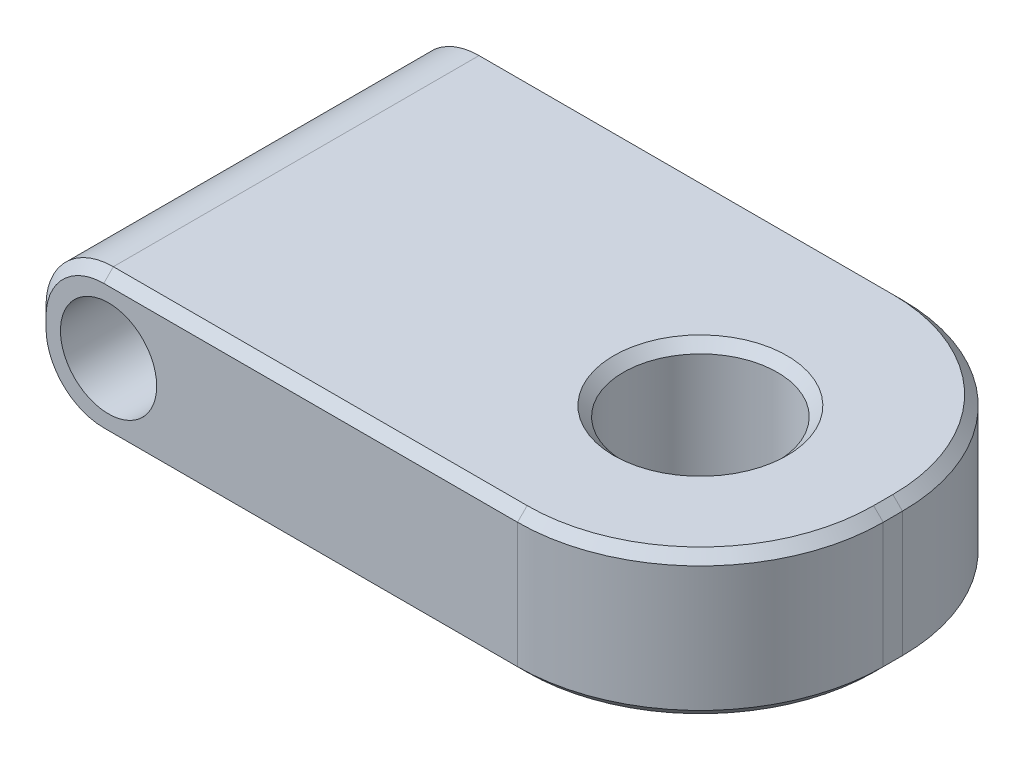
ISO-10303-21;
HEADER;
FILE_DESCRIPTION(('STEP AP214'),'2;1');
FILE_NAME('part.step','',(''),(''),'','','');
FILE_SCHEMA(('AUTOMOTIVE_DESIGN { 1 0 10303 214 1 1 1 1 }'));
ENDSEC;
DATA;
#1=APPLICATION_CONTEXT('core data for automotive mechanical design processes');
#2=APPLICATION_PROTOCOL_DEFINITION('international standard','automotive_design',2000,#1);
#3=PRODUCT_CONTEXT('',#1,'mechanical');
#4=PRODUCT('Part','Part','',(#3));
#5=PRODUCT_RELATED_PRODUCT_CATEGORY('part','',(#4));
#6=PRODUCT_DEFINITION_FORMATION('','',#4);
#7=PRODUCT_DEFINITION_CONTEXT('part definition',#1,'design');
#8=PRODUCT_DEFINITION('design','',#6,#7);
#9=PRODUCT_DEFINITION_SHAPE('','',#8);
#10=(LENGTH_UNIT() NAMED_UNIT(*) SI_UNIT(.MILLI.,.METRE.));
#11=(NAMED_UNIT(*) PLANE_ANGLE_UNIT() SI_UNIT($,.RADIAN.));
#12=(NAMED_UNIT(*) SI_UNIT($,.STERADIAN.) SOLID_ANGLE_UNIT());
#13=UNCERTAINTY_MEASURE_WITH_UNIT(LENGTH_MEASURE(1.E-05),#10,'distance_accuracy_value','');
#14=(GEOMETRIC_REPRESENTATION_CONTEXT(3) GLOBAL_UNCERTAINTY_ASSIGNED_CONTEXT((#13)) GLOBAL_UNIT_ASSIGNED_CONTEXT((#10,
#11,#12)) REPRESENTATION_CONTEXT('',''));
#15=CARTESIAN_POINT('',(0.,0.,0.));
#16=DIRECTION('',(0.,0.,1.));
#17=DIRECTION('',(1.,0.,0.));
#18=AXIS2_PLACEMENT_3D('',#15,#16,#17);
#19=CARTESIAN_POINT('',(-34.5,15.,20.));
#20=DIRECTION('',(1.,0.,0.));
#21=DIRECTION('',(0.,0.,-1.));
#22=AXIS2_PLACEMENT_3D('',#19,#20,#21);
#23=PLANE('',#22);
#24=DIRECTION('',(0.,0.,1.));
#25=VECTOR('',#24,1.);
#26=CARTESIAN_POINT('',(-34.5,8.,-20.));
#27=LINE('',#26,#25);
#28=CARTESIAN_POINT('',(-34.5,8.,19.));
#29=VERTEX_POINT('',#28);
#30=CARTESIAN_POINT('',(-34.5,8.,-19.));
#31=VERTEX_POINT('',#30);
#32=EDGE_CURVE('E248',#29,#31,#27,.F.);
#33=ORIENTED_EDGE('',*,*,#32,.T.);
#34=DIRECTION('',(0.,-1.,0.));
#35=VECTOR('',#34,1.);
#36=CARTESIAN_POINT('',(-34.5,15.,-19.));
#37=LINE('',#36,#35);
#38=CARTESIAN_POINT('',(-34.5,7.,-19.));
#39=VERTEX_POINT('',#38);
#40=EDGE_CURVE('E315',#31,#39,#37,.T.);
#41=ORIENTED_EDGE('',*,*,#40,.T.);
#42=DIRECTION('',(0.,0.,1.));
#43=VECTOR('',#42,1.);
#44=CARTESIAN_POINT('',(-34.5,7.,20.));
#45=LINE('',#44,#43);
#46=CARTESIAN_POINT('',(-34.5,7.,19.));
#47=VERTEX_POINT('',#46);
#48=EDGE_CURVE('E167',#39,#47,#45,.T.);
#49=ORIENTED_EDGE('',*,*,#48,.T.);
#50=DIRECTION('',(0.,1.,0.));
#51=VECTOR('',#50,1.);
#52=CARTESIAN_POINT('',(-34.5,15.,19.));
#53=LINE('',#52,#51);
#54=EDGE_CURVE('E54',#47,#29,#53,.T.);
#55=ORIENTED_EDGE('',*,*,#54,.T.);
#56=EDGE_LOOP('',(#33,#41,#49,#55));
#57=FACE_BOUND('',#56,.T.);
#58=ADVANCED_FACE('F32',(#57),#23,.F.);
#59=CARTESIAN_POINT('',(15.5,15.,20.));
#60=DIRECTION('',(0.,0.,-1.));
#61=DIRECTION('',(-1.,0.,0.));
#62=AXIS2_PLACEMENT_3D('',#59,#60,#61);
#63=PLANE('',#62);
#64=CARTESIAN_POINT('',(-27.,7.5,20.));
#65=DIRECTION('',(0.,0.,1.));
#66=DIRECTION('',(1.,0.,0.));
#67=AXIS2_PLACEMENT_3D('',#64,#65,#66);
#68=CIRCLE('',#67,5.);
#69=CARTESIAN_POINT('',(-22.,7.5,20.));
#70=VERTEX_POINT('',#69);
#71=EDGE_CURVE('E223',#70,#70,#68,.T.);
#72=ORIENTED_EDGE('',*,*,#71,.F.);
#73=EDGE_LOOP('',(#72));
#74=FACE_BOUND('',#73,.T.);
#75=CARTESIAN_POINT('',(-27.5,7.,20.));
#76=DIRECTION('',(0.,0.,-1.));
#77=DIRECTION('',(-1.,0.,0.));
#78=AXIS2_PLACEMENT_3D('',#75,#76,#77);
#79=CIRCLE('',#78,6.00000000000001);
#80=CARTESIAN_POINT('',(-33.5,7.,20.));
#81=VERTEX_POINT('',#80);
#82=CARTESIAN_POINT('',(-27.5,0.999999999999989,20.));
#83=VERTEX_POINT('',#82);
#84=EDGE_CURVE('E311',#81,#83,#79,.F.);
#85=ORIENTED_EDGE('',*,*,#84,.T.);
#86=DIRECTION('',(1.,0.,0.));
#87=VECTOR('',#86,1.);
#88=CARTESIAN_POINT('',(15.5,0.99999999999999,20.));
#89=LINE('',#88,#87);
#90=CARTESIAN_POINT('',(15.5,0.99999999999999,20.));
#91=VERTEX_POINT('',#90);
#92=EDGE_CURVE('E181',#83,#91,#89,.T.);
#93=ORIENTED_EDGE('',*,*,#92,.T.);
#94=DIRECTION('',(0.,-1.,0.));
#95=VECTOR('',#94,1.);
#96=CARTESIAN_POINT('',(15.5,15.,20.));
#97=LINE('',#96,#95);
#98=CARTESIAN_POINT('',(15.5,14.,20.));
#99=VERTEX_POINT('',#98);
#100=EDGE_CURVE('E245',#99,#91,#97,.T.);
#101=ORIENTED_EDGE('',*,*,#100,.F.);
#102=DIRECTION('',(-1.,0.,0.));
#103=VECTOR('',#102,1.);
#104=CARTESIAN_POINT('',(-27.5,14.,20.));
#105=LINE('',#104,#103);
#106=CARTESIAN_POINT('',(-27.5,14.,20.));
#107=VERTEX_POINT('',#106);
#108=EDGE_CURVE('E305',#99,#107,#105,.T.);
#109=ORIENTED_EDGE('',*,*,#108,.T.);
#110=CARTESIAN_POINT('',(-27.5,8.,20.));
#111=DIRECTION('',(0.,0.,-1.));
#112=DIRECTION('',(-1.,0.,0.));
#113=AXIS2_PLACEMENT_3D('',#110,#111,#112);
#114=CIRCLE('',#113,6.00000000000001);
#115=CARTESIAN_POINT('',(-33.5,8.,20.));
#116=VERTEX_POINT('',#115);
#117=EDGE_CURVE('E307',#107,#116,#114,.F.);
#118=ORIENTED_EDGE('',*,*,#117,.T.);
#119=DIRECTION('',(0.,-1.,0.));
#120=VECTOR('',#119,1.);
#121=CARTESIAN_POINT('',(-33.5,15.,20.));
#122=LINE('',#121,#120);
#123=EDGE_CURVE('E309',#116,#81,#122,.T.);
#124=ORIENTED_EDGE('',*,*,#123,.T.);
#125=EDGE_LOOP('',(#85,#93,#101,#109,#118,#124));
#126=FACE_BOUND('',#125,.T.);
#127=ADVANCED_FACE('F340',(#74,#126),#63,.F.);
#128=CARTESIAN_POINT('',(15.5,15.,1.));
#129=DIRECTION('',(0.,-1.,0.));
#130=DIRECTION('',(0.,0.,-1.));
#131=AXIS2_PLACEMENT_3D('',#128,#129,#130);
#132=CYLINDRICAL_SURFACE('',#131,19.);
#133=ORIENTED_EDGE('',*,*,#100,.T.);
#134=CARTESIAN_POINT('',(15.5,1.00000000000001,1.));
#135=DIRECTION('',(0.,1.,0.));
#136=DIRECTION('',(0.,0.,1.));
#137=AXIS2_PLACEMENT_3D('',#134,#135,#136);
#138=CIRCLE('',#137,19.);
#139=CARTESIAN_POINT('',(34.5,0.99999999999999,1.));
#140=VERTEX_POINT('',#139);
#141=EDGE_CURVE('E284',#91,#140,#138,.T.);
#142=ORIENTED_EDGE('',*,*,#141,.T.);
#143=DIRECTION('',(0.,-1.,0.));
#144=VECTOR('',#143,1.);
#145=CARTESIAN_POINT('',(34.5,15.,1.));
#146=LINE('',#145,#144);
#147=CARTESIAN_POINT('',(34.5,14.,1.));
#148=VERTEX_POINT('',#147);
#149=EDGE_CURVE('E242',#148,#140,#146,.T.);
#150=ORIENTED_EDGE('',*,*,#149,.F.);
#151=CARTESIAN_POINT('',(15.5,14.,1.));
#152=DIRECTION('',(0.,1.,0.));
#153=DIRECTION('',(0.,0.,1.));
#154=AXIS2_PLACEMENT_3D('',#151,#152,#153);
#155=CIRCLE('',#154,19.);
#156=EDGE_CURVE('E282',#148,#99,#155,.F.);
#157=ORIENTED_EDGE('',*,*,#156,.T.);
#158=EDGE_LOOP('',(#133,#142,#150,#157));
#159=FACE_BOUND('',#158,.T.);
#160=ADVANCED_FACE('F326',(#159),#132,.T.);
#161=CARTESIAN_POINT('',(34.5,15.,1.));
#162=DIRECTION('',(-1.,0.,0.));
#163=DIRECTION('',(0.,0.,1.));
#164=AXIS2_PLACEMENT_3D('',#161,#162,#163);
#165=PLANE('',#164);
#166=ORIENTED_EDGE('',*,*,#149,.T.);
#167=DIRECTION('',(0.,0.,-1.));
#168=VECTOR('',#167,1.);
#169=CARTESIAN_POINT('',(34.5,0.99999999999999,1.));
#170=LINE('',#169,#168);
#171=CARTESIAN_POINT('',(34.5,0.99999999999999,-1.));
#172=VERTEX_POINT('',#171);
#173=EDGE_CURVE('E293',#140,#172,#170,.T.);
#174=ORIENTED_EDGE('',*,*,#173,.T.);
#175=DIRECTION('',(0.,-1.,0.));
#176=VECTOR('',#175,1.);
#177=CARTESIAN_POINT('',(34.5,15.,-1.));
#178=LINE('',#177,#176);
#179=CARTESIAN_POINT('',(34.5,14.,-1.));
#180=VERTEX_POINT('',#179);
#181=EDGE_CURVE('E239',#180,#172,#178,.T.);
#182=ORIENTED_EDGE('',*,*,#181,.F.);
#183=DIRECTION('',(0.,0.,1.));
#184=VECTOR('',#183,1.);
#185=CARTESIAN_POINT('',(34.5,14.,1.));
#186=LINE('',#185,#184);
#187=EDGE_CURVE('E291',#180,#148,#186,.T.);
#188=ORIENTED_EDGE('',*,*,#187,.T.);
#189=EDGE_LOOP('',(#166,#174,#182,#188));
#190=FACE_BOUND('',#189,.T.);
#191=ADVANCED_FACE('F330',(#190),#165,.F.);
#192=CARTESIAN_POINT('',(15.5,15.,-1.));
#193=DIRECTION('',(0.,-1.,0.));
#194=DIRECTION('',(0.,0.,-1.));
#195=AXIS2_PLACEMENT_3D('',#192,#193,#194);
#196=CYLINDRICAL_SURFACE('',#195,19.);
#197=ORIENTED_EDGE('',*,*,#181,.T.);
#198=CARTESIAN_POINT('',(15.5,0.99999999999999,-1.));
#199=DIRECTION('',(0.,1.,0.));
#200=DIRECTION('',(0.,0.,1.));
#201=AXIS2_PLACEMENT_3D('',#198,#199,#200);
#202=CIRCLE('',#201,19.);
#203=CARTESIAN_POINT('',(15.5,0.99999999999999,-20.));
#204=VERTEX_POINT('',#203);
#205=EDGE_CURVE('E289',#172,#204,#202,.T.);
#206=ORIENTED_EDGE('',*,*,#205,.T.);
#207=DIRECTION('',(0.,-1.,0.));
#208=VECTOR('',#207,1.);
#209=CARTESIAN_POINT('',(15.5,15.,-20.));
#210=LINE('',#209,#208);
#211=CARTESIAN_POINT('',(15.5,14.,-20.));
#212=VERTEX_POINT('',#211);
#213=EDGE_CURVE('E234',#212,#204,#210,.T.);
#214=ORIENTED_EDGE('',*,*,#213,.F.);
#215=CARTESIAN_POINT('',(15.5,14.,-1.));
#216=DIRECTION('',(0.,1.,0.));
#217=DIRECTION('',(0.,0.,1.));
#218=AXIS2_PLACEMENT_3D('',#215,#216,#217);
#219=CIRCLE('',#218,19.);
#220=EDGE_CURVE('E287',#212,#180,#219,.F.);
#221=ORIENTED_EDGE('',*,*,#220,.T.);
#222=EDGE_LOOP('',(#197,#206,#214,#221));
#223=FACE_BOUND('',#222,.T.);
#224=ADVANCED_FACE('F573',(#223),#196,.T.);
#225=CARTESIAN_POINT('',(15.5,15.,-20.));
#226=DIRECTION('',(0.,0.,1.));
#227=DIRECTION('',(1.,0.,0.));
#228=AXIS2_PLACEMENT_3D('',#225,#226,#227);
#229=PLANE('',#228);
#230=CARTESIAN_POINT('',(-27.,7.5,-20.));
#231=DIRECTION('',(0.,0.,1.));
#232=DIRECTION('',(1.,0.,0.));
#233=AXIS2_PLACEMENT_3D('',#230,#231,#232);
#234=CIRCLE('',#233,5.);
#235=CARTESIAN_POINT('',(-22.,7.5,-20.));
#236=VERTEX_POINT('',#235);
#237=EDGE_CURVE('E229',#236,#236,#234,.T.);
#238=ORIENTED_EDGE('',*,*,#237,.T.);
#239=EDGE_LOOP('',(#238));
#240=FACE_BOUND('',#239,.T.);
#241=ORIENTED_EDGE('',*,*,#213,.T.);
#242=DIRECTION('',(-1.,0.,0.));
#243=VECTOR('',#242,1.);
#244=CARTESIAN_POINT('',(15.5,0.99999999999999,-20.));
#245=LINE('',#244,#243);
#246=CARTESIAN_POINT('',(-27.5,0.999999999999987,-20.));
#247=VERTEX_POINT('',#246);
#248=EDGE_CURVE('E178',#204,#247,#245,.T.);
#249=ORIENTED_EDGE('',*,*,#248,.T.);
#250=CARTESIAN_POINT('',(-27.5,7.,-20.));
#251=DIRECTION('',(0.,0.,1.));
#252=DIRECTION('',(1.,0.,0.));
#253=AXIS2_PLACEMENT_3D('',#250,#251,#252);
#254=CIRCLE('',#253,6.00000000000001);
#255=CARTESIAN_POINT('',(-33.5,7.,-20.));
#256=VERTEX_POINT('',#255);
#257=EDGE_CURVE('E301',#247,#256,#254,.F.);
#258=ORIENTED_EDGE('',*,*,#257,.T.);
#259=DIRECTION('',(0.,1.,0.));
#260=VECTOR('',#259,1.);
#261=CARTESIAN_POINT('',(-33.5,15.,-20.));
#262=LINE('',#261,#260);
#263=CARTESIAN_POINT('',(-33.5,8.,-20.));
#264=VERTEX_POINT('',#263);
#265=EDGE_CURVE('E299',#256,#264,#262,.T.);
#266=ORIENTED_EDGE('',*,*,#265,.T.);
#267=CARTESIAN_POINT('',(-27.5,8.,-20.));
#268=DIRECTION('',(0.,0.,1.));
#269=DIRECTION('',(1.,0.,0.));
#270=AXIS2_PLACEMENT_3D('',#267,#268,#269);
#271=CIRCLE('',#270,6.00000000000001);
#272=CARTESIAN_POINT('',(-27.5,14.,-20.));
#273=VERTEX_POINT('',#272);
#274=EDGE_CURVE('E297',#264,#273,#271,.F.);
#275=ORIENTED_EDGE('',*,*,#274,.T.);
#276=DIRECTION('',(1.,0.,0.));
#277=VECTOR('',#276,1.);
#278=CARTESIAN_POINT('',(15.5,14.,-20.));
#279=LINE('',#278,#277);
#280=EDGE_CURVE('E295',#273,#212,#279,.T.);
#281=ORIENTED_EDGE('',*,*,#280,.T.);
#282=EDGE_LOOP('',(#241,#249,#258,#266,#275,#281));
#283=FACE_BOUND('',#282,.T.);
#284=ADVANCED_FACE('F564',(#240,#283),#229,.F.);
#285=CARTESIAN_POINT('',(15.5,15.,-1.));
#286=DIRECTION('',(0.,1.,0.));
#287=DIRECTION('',(0.,0.,1.));
#288=AXIS2_PLACEMENT_3D('',#285,#286,#287);
#289=PLANE('',#288);
#290=CARTESIAN_POINT('',(15.5,15.,1.));
#291=DIRECTION('',(0.,1.,0.));
#292=DIRECTION('',(0.,0.,1.));
#293=AXIS2_PLACEMENT_3D('',#290,#291,#292);
#294=CIRCLE('',#293,8.99999999999999);
#295=CARTESIAN_POINT('',(15.5,15.,9.99999999999999));
#296=VERTEX_POINT('',#295);
#297=EDGE_CURVE('E279',#296,#296,#294,.F.);
#298=ORIENTED_EDGE('',*,*,#297,.T.);
#299=EDGE_LOOP('',(#298));
#300=FACE_BOUND('',#299,.T.);
#301=CARTESIAN_POINT('',(15.5,15.,-1.));
#302=DIRECTION('',(0.,1.,0.));
#303=DIRECTION('',(0.,0.,1.));
#304=AXIS2_PLACEMENT_3D('',#301,#302,#303);
#305=CIRCLE('',#304,18.);
#306=CARTESIAN_POINT('',(33.5,15.,-1.));
#307=VERTEX_POINT('',#306);
#308=CARTESIAN_POINT('',(15.5,15.,-19.));
#309=VERTEX_POINT('',#308);
#310=EDGE_CURVE('E275',#307,#309,#305,.T.);
#311=ORIENTED_EDGE('',*,*,#310,.T.);
#312=DIRECTION('',(-1.,0.,0.));
#313=VECTOR('',#312,1.);
#314=CARTESIAN_POINT('',(-27.5,15.,-19.));
#315=LINE('',#314,#313);
#316=CARTESIAN_POINT('',(-27.5,15.,-19.));
#317=VERTEX_POINT('',#316);
#318=EDGE_CURVE('E277',#309,#317,#315,.T.);
#319=ORIENTED_EDGE('',*,*,#318,.T.);
#320=DIRECTION('',(0.,0.,1.));
#321=VECTOR('',#320,1.);
#322=CARTESIAN_POINT('',(-27.5,15.,20.));
#323=LINE('',#322,#321);
#324=CARTESIAN_POINT('',(-27.5,15.,19.));
#325=VERTEX_POINT('',#324);
#326=EDGE_CURVE('E158',#317,#325,#323,.T.);
#327=ORIENTED_EDGE('',*,*,#326,.T.);
#328=DIRECTION('',(1.,0.,0.));
#329=VECTOR('',#328,1.);
#330=CARTESIAN_POINT('',(15.5,15.,19.));
#331=LINE('',#330,#329);
#332=CARTESIAN_POINT('',(15.5,15.,19.));
#333=VERTEX_POINT('',#332);
#334=EDGE_CURVE('E273',#325,#333,#331,.T.);
#335=ORIENTED_EDGE('',*,*,#334,.T.);
#336=CARTESIAN_POINT('',(15.5,15.,1.));
#337=DIRECTION('',(0.,1.,0.));
#338=DIRECTION('',(0.,0.,1.));
#339=AXIS2_PLACEMENT_3D('',#336,#337,#338);
#340=CIRCLE('',#339,18.);
#341=CARTESIAN_POINT('',(33.5,15.,1.));
#342=VERTEX_POINT('',#341);
#343=EDGE_CURVE('E269',#333,#342,#340,.T.);
#344=ORIENTED_EDGE('',*,*,#343,.T.);
#345=DIRECTION('',(0.,0.,-1.));
#346=VECTOR('',#345,1.);
#347=CARTESIAN_POINT('',(33.5,15.,-1.));
#348=LINE('',#347,#346);
#349=EDGE_CURVE('E271',#342,#307,#348,.T.);
#350=ORIENTED_EDGE('',*,*,#349,.T.);
#351=EDGE_LOOP('',(#311,#319,#327,#335,#344,#350));
#352=FACE_BOUND('',#351,.T.);
#353=ADVANCED_FACE('F354',(#300,#352),#289,.T.);
#354=CARTESIAN_POINT('',(15.5,0.,-1.));
#355=DIRECTION('',(0.,1.,0.));
#356=DIRECTION('',(0.,0.,1.));
#357=AXIS2_PLACEMENT_3D('',#354,#355,#356);
#358=PLANE('',#357);
#359=CARTESIAN_POINT('',(15.5,0.,1.));
#360=DIRECTION('',(0.,1.,0.));
#361=DIRECTION('',(0.,0.,1.));
#362=AXIS2_PLACEMENT_3D('',#359,#360,#361);
#363=CIRCLE('',#362,9.00000000000001);
#364=CARTESIAN_POINT('',(15.5,0.,10.));
#365=VERTEX_POINT('',#364);
#366=EDGE_CURVE('E260',#365,#365,#363,.T.);
#367=ORIENTED_EDGE('',*,*,#366,.T.);
#368=EDGE_LOOP('',(#367));
#369=FACE_BOUND('',#368,.T.);
#370=DIRECTION('',(0.,0.,1.));
#371=VECTOR('',#370,1.);
#372=CARTESIAN_POINT('',(-27.5,0.,-1.));
#373=LINE('',#372,#371);
#374=CARTESIAN_POINT('',(-27.5,0.,19.));
#375=VERTEX_POINT('',#374);
#376=CARTESIAN_POINT('',(-27.5,0.,-19.));
#377=VERTEX_POINT('',#376);
#378=EDGE_CURVE('E151',#375,#377,#373,.F.);
#379=ORIENTED_EDGE('',*,*,#378,.T.);
#380=DIRECTION('',(1.,0.,0.));
#381=VECTOR('',#380,1.);
#382=CARTESIAN_POINT('',(15.5,0.,-19.));
#383=LINE('',#382,#381);
#384=CARTESIAN_POINT('',(15.5,0.,-19.));
#385=VERTEX_POINT('',#384);
#386=EDGE_CURVE('E258',#377,#385,#383,.T.);
#387=ORIENTED_EDGE('',*,*,#386,.T.);
#388=CARTESIAN_POINT('',(15.5,0.,-1.));
#389=DIRECTION('',(0.,1.,0.));
#390=DIRECTION('',(0.,0.,1.));
#391=AXIS2_PLACEMENT_3D('',#388,#389,#390);
#392=CIRCLE('',#391,18.);
#393=CARTESIAN_POINT('',(33.5,0.,-1.));
#394=VERTEX_POINT('',#393);
#395=EDGE_CURVE('E256',#385,#394,#392,.F.);
#396=ORIENTED_EDGE('',*,*,#395,.T.);
#397=DIRECTION('',(0.,0.,1.));
#398=VECTOR('',#397,1.);
#399=CARTESIAN_POINT('',(33.5,0.,-1.));
#400=LINE('',#399,#398);
#401=CARTESIAN_POINT('',(33.5,0.,1.));
#402=VERTEX_POINT('',#401);
#403=EDGE_CURVE('E254',#394,#402,#400,.T.);
#404=ORIENTED_EDGE('',*,*,#403,.T.);
#405=CARTESIAN_POINT('',(15.5,0.,1.));
#406=DIRECTION('',(0.,1.,0.));
#407=DIRECTION('',(0.,0.,1.));
#408=AXIS2_PLACEMENT_3D('',#405,#406,#407);
#409=CIRCLE('',#408,18.);
#410=CARTESIAN_POINT('',(15.5,0.,19.));
#411=VERTEX_POINT('',#410);
#412=EDGE_CURVE('E154',#402,#411,#409,.F.);
#413=ORIENTED_EDGE('',*,*,#412,.T.);
#414=DIRECTION('',(-1.,0.,0.));
#415=VECTOR('',#414,1.);
#416=CARTESIAN_POINT('',(15.5,0.,19.));
#417=LINE('',#416,#415);
#418=EDGE_CURVE('E148',#411,#375,#417,.T.);
#419=ORIENTED_EDGE('',*,*,#418,.T.);
#420=EDGE_LOOP('',(#379,#387,#396,#404,#413,#419));
#421=FACE_BOUND('',#420,.T.);
#422=ADVANCED_FACE('F150',(#369,#421),#358,.F.);
#423=CARTESIAN_POINT('',(-27.,7.5,-20.));
#424=DIRECTION('',(0.,0.,1.));
#425=DIRECTION('',(1.,0.,0.));
#426=AXIS2_PLACEMENT_3D('',#423,#424,#425);
#427=CYLINDRICAL_SURFACE('',#426,5.);
#428=ORIENTED_EDGE('',*,*,#237,.F.);
#429=EDGE_LOOP('',(#428));
#430=FACE_BOUND('',#429,.T.);
#431=ORIENTED_EDGE('',*,*,#71,.T.);
#432=EDGE_LOOP('',(#431));
#433=FACE_BOUND('',#432,.T.);
#434=ADVANCED_FACE('F380',(#430,#433),#427,.F.);
#435=CARTESIAN_POINT('',(-27.5,7.,20.));
#436=DIRECTION('',(0.,0.,1.));
#437=DIRECTION('',(1.,0.,0.));
#438=AXIS2_PLACEMENT_3D('',#435,#436,#437);
#439=CYLINDRICAL_SURFACE('',#438,7.);
#440=ORIENTED_EDGE('',*,*,#48,.F.);
#441=CARTESIAN_POINT('',(-27.5,7.,-19.));
#442=DIRECTION('',(0.,0.,1.));
#443=DIRECTION('',(1.,0.,0.));
#444=AXIS2_PLACEMENT_3D('',#441,#442,#443);
#445=CIRCLE('',#444,7.);
#446=EDGE_CURVE('E166',#39,#377,#445,.T.);
#447=ORIENTED_EDGE('',*,*,#446,.T.);
#448=ORIENTED_EDGE('',*,*,#378,.F.);
#449=CARTESIAN_POINT('',(-27.5,7.,19.));
#450=DIRECTION('',(0.,0.,-1.));
#451=DIRECTION('',(-1.,0.,0.));
#452=AXIS2_PLACEMENT_3D('',#449,#450,#451);
#453=CIRCLE('',#452,7.);
#454=EDGE_CURVE('E164',#375,#47,#453,.T.);
#455=ORIENTED_EDGE('',*,*,#454,.T.);
#456=EDGE_LOOP('',(#440,#447,#448,#455));
#457=FACE_BOUND('',#456,.T.);
#458=ADVANCED_FACE('F163',(#457),#439,.T.);
#459=CARTESIAN_POINT('',(-27.5,8.,-1.));
#460=DIRECTION('',(0.,0.,-1.));
#461=DIRECTION('',(-1.,0.,0.));
#462=AXIS2_PLACEMENT_3D('',#459,#460,#461);
#463=CYLINDRICAL_SURFACE('',#462,7.);
#464=ORIENTED_EDGE('',*,*,#326,.F.);
#465=CARTESIAN_POINT('',(-27.5,8.,-19.));
#466=DIRECTION('',(0.,0.,1.));
#467=DIRECTION('',(1.,0.,0.));
#468=AXIS2_PLACEMENT_3D('',#465,#466,#467);
#469=CIRCLE('',#468,7.);
#470=EDGE_CURVE('E11',#317,#31,#469,.T.);
#471=ORIENTED_EDGE('',*,*,#470,.T.);
#472=ORIENTED_EDGE('',*,*,#32,.F.);
#473=CARTESIAN_POINT('',(-27.5,8.,19.));
#474=DIRECTION('',(0.,0.,-1.));
#475=DIRECTION('',(-1.,0.,0.));
#476=AXIS2_PLACEMENT_3D('',#473,#474,#475);
#477=CIRCLE('',#476,7.);
#478=EDGE_CURVE('E41',#29,#325,#477,.T.);
#479=ORIENTED_EDGE('',*,*,#478,.T.);
#480=EDGE_LOOP('',(#464,#471,#472,#479));
#481=FACE_BOUND('',#480,.T.);
#482=ADVANCED_FACE('F350',(#481),#463,.T.);
#483=CARTESIAN_POINT('',(15.5,0.,1.));
#484=DIRECTION('',(0.,1.,0.));
#485=DIRECTION('',(0.,0.,1.));
#486=AXIS2_PLACEMENT_3D('',#483,#484,#485);
#487=CYLINDRICAL_SURFACE('',#486,8.);
#488=CARTESIAN_POINT('',(15.5,1.00000000000001,1.));
#489=DIRECTION('',(0.,1.,0.));
#490=DIRECTION('',(0.,0.,1.));
#491=AXIS2_PLACEMENT_3D('',#488,#489,#490);
#492=CIRCLE('',#491,8.);
#493=CARTESIAN_POINT('',(15.5,1.00000000000001,9.));
#494=VERTEX_POINT('',#493);
#495=EDGE_CURVE('E266',#494,#494,#492,.F.);
#496=ORIENTED_EDGE('',*,*,#495,.T.);
#497=EDGE_LOOP('',(#496));
#498=FACE_BOUND('',#497,.T.);
#499=CARTESIAN_POINT('',(15.5,14.,1.));
#500=DIRECTION('',(0.,1.,0.));
#501=DIRECTION('',(0.,0.,1.));
#502=AXIS2_PLACEMENT_3D('',#499,#500,#501);
#503=CIRCLE('',#502,8.);
#504=CARTESIAN_POINT('',(15.5,14.,9.));
#505=VERTEX_POINT('',#504);
#506=EDGE_CURVE('E263',#505,#505,#503,.T.);
#507=ORIENTED_EDGE('',*,*,#506,.T.);
#508=EDGE_LOOP('',(#507));
#509=FACE_BOUND('',#508,.T.);
#510=ADVANCED_FACE('F383',(#498,#509),#487,.F.);
#511=CARTESIAN_POINT('',(15.5,0.,1.));
#512=DIRECTION('',(0.,-1.,0.));
#513=DIRECTION('',(0.,0.,-1.));
#514=AXIS2_PLACEMENT_3D('',#511,#512,#513);
#515=CONICAL_SURFACE('',#514,9.00000000000001,0.785398163397452);
#516=ORIENTED_EDGE('',*,*,#495,.F.);
#517=EDGE_LOOP('',(#516));
#518=FACE_BOUND('',#517,.T.);
#519=ORIENTED_EDGE('',*,*,#366,.F.);
#520=EDGE_LOOP('',(#519));
#521=FACE_BOUND('',#520,.T.);
#522=ADVANCED_FACE('F384',(#518,#521),#515,.F.);
#523=CARTESIAN_POINT('',(15.5,14.,1.));
#524=DIRECTION('',(0.,1.,0.));
#525=DIRECTION('',(0.,0.,1.));
#526=AXIS2_PLACEMENT_3D('',#523,#524,#525);
#527=CONICAL_SURFACE('',#526,8.,0.785398163397445);
#528=ORIENTED_EDGE('',*,*,#297,.F.);
#529=EDGE_LOOP('',(#528));
#530=FACE_BOUND('',#529,.T.);
#531=ORIENTED_EDGE('',*,*,#506,.F.);
#532=EDGE_LOOP('',(#531));
#533=FACE_BOUND('',#532,.T.);
#534=ADVANCED_FACE('F387',(#530,#533),#527,.F.);
#535=CARTESIAN_POINT('',(15.5,15.,-1.));
#536=DIRECTION('',(0.,-1.,0.));
#537=DIRECTION('',(0.,0.,-1.));
#538=AXIS2_PLACEMENT_3D('',#535,#536,#537);
#539=CONICAL_SURFACE('',#538,18.,0.78539816339745);
#540=DIRECTION('',(0.,-0.707106781186546,-0.707106781186549));
#541=VECTOR('',#540,1.);
#542=CARTESIAN_POINT('',(15.5,15.,-19.));
#543=LINE('',#542,#541);
#544=EDGE_CURVE('E216',#309,#212,#543,.T.);
#545=ORIENTED_EDGE('',*,*,#544,.F.);
#546=ORIENTED_EDGE('',*,*,#310,.F.);
#547=DIRECTION('',(-0.707106781186549,0.707106781186546,0.));
#548=VECTOR('',#547,1.);
#549=CARTESIAN_POINT('',(34.5,14.,-1.));
#550=LINE('',#549,#548);
#551=EDGE_CURVE('E36',#180,#307,#550,.T.);
#552=ORIENTED_EDGE('',*,*,#551,.F.);
#553=ORIENTED_EDGE('',*,*,#220,.F.);
#554=EDGE_LOOP('',(#545,#546,#552,#553));
#555=FACE_BOUND('',#554,.T.);
#556=ADVANCED_FACE('F34',(#555),#539,.T.);
#557=CARTESIAN_POINT('',(33.5,15.,-1.));
#558=DIRECTION('',(0.707106781186546,0.707106781186549,0.));
#559=DIRECTION('',(0.,0.,1.));
#560=AXIS2_PLACEMENT_3D('',#557,#558,#559);
#561=PLANE('',#560);
#562=ORIENTED_EDGE('',*,*,#551,.T.);
#563=ORIENTED_EDGE('',*,*,#349,.F.);
#564=DIRECTION('',(-0.707106781186549,0.707106781186546,0.));
#565=VECTOR('',#564,1.);
#566=CARTESIAN_POINT('',(34.5,14.,1.));
#567=LINE('',#566,#565);
#568=EDGE_CURVE('E214',#148,#342,#567,.T.);
#569=ORIENTED_EDGE('',*,*,#568,.F.);
#570=ORIENTED_EDGE('',*,*,#187,.F.);
#571=EDGE_LOOP('',(#562,#563,#569,#570));
#572=FACE_BOUND('',#571,.T.);
#573=ADVANCED_FACE('F332',(#572),#561,.T.);
#574=CARTESIAN_POINT('',(15.5,15.,-19.));
#575=DIRECTION('',(0.,0.707106781186549,-0.707106781186546));
#576=DIRECTION('',(1.,0.,0.));
#577=AXIS2_PLACEMENT_3D('',#574,#575,#576);
#578=PLANE('',#577);
#579=ORIENTED_EDGE('',*,*,#544,.T.);
#580=ORIENTED_EDGE('',*,*,#280,.F.);
#581=DIRECTION('',(0.,-0.707106781186546,-0.707106781186549));
#582=VECTOR('',#581,1.);
#583=CARTESIAN_POINT('',(-27.5,15.,-19.));
#584=LINE('',#583,#582);
#585=EDGE_CURVE('E211',#317,#273,#584,.T.);
#586=ORIENTED_EDGE('',*,*,#585,.F.);
#587=ORIENTED_EDGE('',*,*,#318,.F.);
#588=EDGE_LOOP('',(#579,#580,#586,#587));
#589=FACE_BOUND('',#588,.T.);
#590=ADVANCED_FACE('F492',(#589),#578,.T.);
#591=CARTESIAN_POINT('',(15.5,15.,1.));
#592=DIRECTION('',(0.,-1.,0.));
#593=DIRECTION('',(0.,0.,-1.));
#594=AXIS2_PLACEMENT_3D('',#591,#592,#593);
#595=CONICAL_SURFACE('',#594,18.,0.78539816339745);
#596=ORIENTED_EDGE('',*,*,#568,.T.);
#597=ORIENTED_EDGE('',*,*,#343,.F.);
#598=DIRECTION('',(0.,0.707106781186546,-0.707106781186549));
#599=VECTOR('',#598,1.);
#600=CARTESIAN_POINT('',(15.5,14.,20.));
#601=LINE('',#600,#599);
#602=EDGE_CURVE('E208',#99,#333,#601,.T.);
#603=ORIENTED_EDGE('',*,*,#602,.F.);
#604=ORIENTED_EDGE('',*,*,#156,.F.);
#605=EDGE_LOOP('',(#596,#597,#603,#604));
#606=FACE_BOUND('',#605,.T.);
#607=ADVANCED_FACE('F337',(#606),#595,.T.);
#608=CARTESIAN_POINT('',(-27.5,8.,-20.));
#609=DIRECTION('',(0.,0.,1.));
#610=DIRECTION('',(1.,0.,0.));
#611=AXIS2_PLACEMENT_3D('',#608,#609,#610);
#612=CONICAL_SURFACE('',#611,6.00000000000001,0.785398163397447);
#613=ORIENTED_EDGE('',*,*,#585,.T.);
#614=ORIENTED_EDGE('',*,*,#274,.F.);
#615=DIRECTION('',(0.707106781186545,0.,-0.70710678118655));
#616=VECTOR('',#615,1.);
#617=CARTESIAN_POINT('',(-34.5,8.,-19.));
#618=LINE('',#617,#616);
#619=EDGE_CURVE('E205',#31,#264,#618,.T.);
#620=ORIENTED_EDGE('',*,*,#619,.F.);
#621=ORIENTED_EDGE('',*,*,#470,.F.);
#622=EDGE_LOOP('',(#613,#614,#620,#621));
#623=FACE_BOUND('',#622,.T.);
#624=ADVANCED_FACE('F359',(#623),#612,.T.);
#625=CARTESIAN_POINT('',(15.5,15.,19.));
#626=DIRECTION('',(0.,0.707106781186549,0.707106781186546));
#627=DIRECTION('',(-1.,0.,0.));
#628=AXIS2_PLACEMENT_3D('',#625,#626,#627);
#629=PLANE('',#628);
#630=ORIENTED_EDGE('',*,*,#602,.T.);
#631=ORIENTED_EDGE('',*,*,#334,.F.);
#632=DIRECTION('',(0.,0.707106781186546,-0.707106781186549));
#633=VECTOR('',#632,1.);
#634=CARTESIAN_POINT('',(-27.5,14.,20.));
#635=LINE('',#634,#633);
#636=EDGE_CURVE('E202',#107,#325,#635,.T.);
#637=ORIENTED_EDGE('',*,*,#636,.F.);
#638=ORIENTED_EDGE('',*,*,#108,.F.);
#639=EDGE_LOOP('',(#630,#631,#637,#638));
#640=FACE_BOUND('',#639,.T.);
#641=ADVANCED_FACE('F356',(#640),#629,.T.);
#642=CARTESIAN_POINT('',(-34.5,15.,-19.));
#643=DIRECTION('',(0.70710678118655,0.,0.707106781186545));
#644=DIRECTION('',(0.,-1.,0.));
#645=AXIS2_PLACEMENT_3D('',#642,#643,#644);
#646=PLANE('',#645);
#647=ORIENTED_EDGE('',*,*,#619,.T.);
#648=ORIENTED_EDGE('',*,*,#265,.F.);
#649=DIRECTION('',(0.707106781186545,0.,-0.70710678118655));
#650=VECTOR('',#649,1.);
#651=CARTESIAN_POINT('',(-34.5,7.,-19.));
#652=LINE('',#651,#650);
#653=EDGE_CURVE('E199',#39,#256,#652,.T.);
#654=ORIENTED_EDGE('',*,*,#653,.F.);
#655=ORIENTED_EDGE('',*,*,#40,.F.);
#656=EDGE_LOOP('',(#647,#648,#654,#655));
#657=FACE_BOUND('',#656,.T.);
#658=ADVANCED_FACE('F358',(#657),#646,.F.);
#659=CARTESIAN_POINT('',(-27.5,8.,20.));
#660=DIRECTION('',(0.,0.,-1.));
#661=DIRECTION('',(-1.,0.,0.));
#662=AXIS2_PLACEMENT_3D('',#659,#660,#661);
#663=CONICAL_SURFACE('',#662,6.00000000000001,0.785398163397445);
#664=ORIENTED_EDGE('',*,*,#636,.T.);
#665=ORIENTED_EDGE('',*,*,#478,.F.);
#666=DIRECTION('',(-0.707106781186545,0.,-0.70710678118655));
#667=VECTOR('',#666,1.);
#668=CARTESIAN_POINT('',(-33.5,8.,20.));
#669=LINE('',#668,#667);
#670=EDGE_CURVE('E196',#116,#29,#669,.T.);
#671=ORIENTED_EDGE('',*,*,#670,.F.);
#672=ORIENTED_EDGE('',*,*,#117,.F.);
#673=EDGE_LOOP('',(#664,#665,#671,#672));
#674=FACE_BOUND('',#673,.T.);
#675=ADVANCED_FACE('F349',(#674),#663,.T.);
#676=CARTESIAN_POINT('',(-27.5,7.,-20.));
#677=DIRECTION('',(0.,0.,1.));
#678=DIRECTION('',(1.,0.,0.));
#679=AXIS2_PLACEMENT_3D('',#676,#677,#678);
#680=CONICAL_SURFACE('',#679,6.00000000000001,0.785398163397445);
#681=ORIENTED_EDGE('',*,*,#653,.T.);
#682=ORIENTED_EDGE('',*,*,#257,.F.);
#683=DIRECTION('',(0.,0.707106781186545,-0.70710678118655));
#684=VECTOR('',#683,1.);
#685=CARTESIAN_POINT('',(-27.5,0.,-19.));
#686=LINE('',#685,#684);
#687=EDGE_CURVE('E193',#377,#247,#686,.T.);
#688=ORIENTED_EDGE('',*,*,#687,.F.);
#689=ORIENTED_EDGE('',*,*,#446,.F.);
#690=EDGE_LOOP('',(#681,#682,#688,#689));
#691=FACE_BOUND('',#690,.T.);
#692=ADVANCED_FACE('F412',(#691),#680,.T.);
#693=CARTESIAN_POINT('',(-33.5,15.,20.));
#694=DIRECTION('',(0.70710678118655,0.,-0.707106781186545));
#695=DIRECTION('',(0.,-1.,0.));
#696=AXIS2_PLACEMENT_3D('',#693,#694,#695);
#697=PLANE('',#696);
#698=ORIENTED_EDGE('',*,*,#670,.T.);
#699=ORIENTED_EDGE('',*,*,#54,.F.);
#700=DIRECTION('',(-0.707106781186545,0.,-0.70710678118655));
#701=VECTOR('',#700,1.);
#702=CARTESIAN_POINT('',(-33.5,7.,20.));
#703=LINE('',#702,#701);
#704=EDGE_CURVE('E177',#81,#47,#703,.T.);
#705=ORIENTED_EDGE('',*,*,#704,.F.);
#706=ORIENTED_EDGE('',*,*,#123,.F.);
#707=EDGE_LOOP('',(#698,#699,#705,#706));
#708=FACE_BOUND('',#707,.T.);
#709=ADVANCED_FACE('F346',(#708),#697,.F.);
#710=CARTESIAN_POINT('',(15.5,0.99999999999999,-20.));
#711=DIRECTION('',(0.,0.707106781186549,0.707106781186546));
#712=DIRECTION('',(-1.,0.,0.));
#713=AXIS2_PLACEMENT_3D('',#710,#711,#712);
#714=PLANE('',#713);
#715=ORIENTED_EDGE('',*,*,#687,.T.);
#716=ORIENTED_EDGE('',*,*,#248,.F.);
#717=DIRECTION('',(0.,0.707106781186546,-0.707106781186549));
#718=VECTOR('',#717,1.);
#719=CARTESIAN_POINT('',(15.5,0.,-19.));
#720=LINE('',#719,#718);
#721=EDGE_CURVE('E182',#385,#204,#720,.T.);
#722=ORIENTED_EDGE('',*,*,#721,.F.);
#723=ORIENTED_EDGE('',*,*,#386,.F.);
#724=EDGE_LOOP('',(#715,#716,#722,#723));
#725=FACE_BOUND('',#724,.T.);
#726=ADVANCED_FACE('F406',(#725),#714,.F.);
#727=CARTESIAN_POINT('',(-27.5,7.,20.));
#728=DIRECTION('',(0.,0.,-1.));
#729=DIRECTION('',(-1.,0.,0.));
#730=AXIS2_PLACEMENT_3D('',#727,#728,#729);
#731=CONICAL_SURFACE('',#730,6.00000000000001,0.785398163397447);
#732=ORIENTED_EDGE('',*,*,#704,.T.);
#733=ORIENTED_EDGE('',*,*,#454,.F.);
#734=DIRECTION('',(0.,-0.707106781186546,-0.707106781186549));
#735=VECTOR('',#734,1.);
#736=CARTESIAN_POINT('',(-27.5,0.999999999999989,20.));
#737=LINE('',#736,#735);
#738=EDGE_CURVE('E174',#83,#375,#737,.T.);
#739=ORIENTED_EDGE('',*,*,#738,.F.);
#740=ORIENTED_EDGE('',*,*,#84,.F.);
#741=EDGE_LOOP('',(#732,#733,#739,#740));
#742=FACE_BOUND('',#741,.T.);
#743=ADVANCED_FACE('F172',(#742),#731,.T.);
#744=CARTESIAN_POINT('',(15.5,0.99999999999999,-1.));
#745=DIRECTION('',(0.,1.,0.));
#746=DIRECTION('',(0.,0.,1.));
#747=AXIS2_PLACEMENT_3D('',#744,#745,#746);
#748=CONICAL_SURFACE('',#747,19.,0.78539816339745);
#749=ORIENTED_EDGE('',*,*,#721,.T.);
#750=ORIENTED_EDGE('',*,*,#205,.F.);
#751=DIRECTION('',(0.707106781186549,0.707106781186546,0.));
#752=VECTOR('',#751,1.);
#753=CARTESIAN_POINT('',(33.5,0.,-1.));
#754=LINE('',#753,#752);
#755=EDGE_CURVE('E183',#394,#172,#754,.T.);
#756=ORIENTED_EDGE('',*,*,#755,.F.);
#757=ORIENTED_EDGE('',*,*,#395,.F.);
#758=EDGE_LOOP('',(#749,#750,#756,#757));
#759=FACE_BOUND('',#758,.T.);
#760=ADVANCED_FACE('F400',(#759),#748,.T.);
#761=CARTESIAN_POINT('',(15.5,0.99999999999999,20.));
#762=DIRECTION('',(0.,0.707106781186549,-0.707106781186546));
#763=DIRECTION('',(1.,0.,0.));
#764=AXIS2_PLACEMENT_3D('',#761,#762,#763);
#765=PLANE('',#764);
#766=ORIENTED_EDGE('',*,*,#738,.T.);
#767=ORIENTED_EDGE('',*,*,#418,.F.);
#768=DIRECTION('',(0.,-0.707106781186546,-0.707106781186549));
#769=VECTOR('',#768,1.);
#770=CARTESIAN_POINT('',(15.5,0.99999999999999,20.));
#771=LINE('',#770,#769);
#772=EDGE_CURVE('E188',#91,#411,#771,.T.);
#773=ORIENTED_EDGE('',*,*,#772,.F.);
#774=ORIENTED_EDGE('',*,*,#92,.F.);
#775=EDGE_LOOP('',(#766,#767,#773,#774));
#776=FACE_BOUND('',#775,.T.);
#777=ADVANCED_FACE('F180',(#776),#765,.F.);
#778=CARTESIAN_POINT('',(34.5,0.99999999999999,1.));
#779=DIRECTION('',(-0.707106781186546,0.707106781186549,0.));
#780=DIRECTION('',(0.,0.,-1.));
#781=AXIS2_PLACEMENT_3D('',#778,#779,#780);
#782=PLANE('',#781);
#783=ORIENTED_EDGE('',*,*,#755,.T.);
#784=ORIENTED_EDGE('',*,*,#173,.F.);
#785=DIRECTION('',(0.707106781186549,0.707106781186546,0.));
#786=VECTOR('',#785,1.);
#787=CARTESIAN_POINT('',(33.5,0.,1.));
#788=LINE('',#787,#786);
#789=EDGE_CURVE('E318',#402,#140,#788,.T.);
#790=ORIENTED_EDGE('',*,*,#789,.F.);
#791=ORIENTED_EDGE('',*,*,#403,.F.);
#792=EDGE_LOOP('',(#783,#784,#790,#791));
#793=FACE_BOUND('',#792,.T.);
#794=ADVANCED_FACE('F394',(#793),#782,.F.);
#795=CARTESIAN_POINT('',(15.5,1.00000000000001,1.));
#796=DIRECTION('',(0.,1.,0.));
#797=DIRECTION('',(0.,0.,1.));
#798=AXIS2_PLACEMENT_3D('',#795,#796,#797);
#799=CONICAL_SURFACE('',#798,19.,0.785398163397445);
#800=ORIENTED_EDGE('',*,*,#772,.T.);
#801=ORIENTED_EDGE('',*,*,#412,.F.);
#802=ORIENTED_EDGE('',*,*,#789,.T.);
#803=ORIENTED_EDGE('',*,*,#141,.F.);
#804=EDGE_LOOP('',(#800,#801,#802,#803));
#805=FACE_BOUND('',#804,.T.);
#806=ADVANCED_FACE('F321',(#805),#799,.T.);
#807=CLOSED_SHELL('',(#58,#127,#160,#191,#224,#284,#353,#422,#434,#458,#482,#510,#522,#534,#556,
#573,#590,#607,#624,#641,#658,#675,#692,#709,#726,#743,#760,#777,#794,#806));
#808=MANIFOLD_SOLID_BREP('B2',#807);
#809=ADVANCED_BREP_SHAPE_REPRESENTATION('',(#18,#808),#14);
#810=SHAPE_DEFINITION_REPRESENTATION(#9,#809);
ENDSEC;
END-ISO-10303-21;
